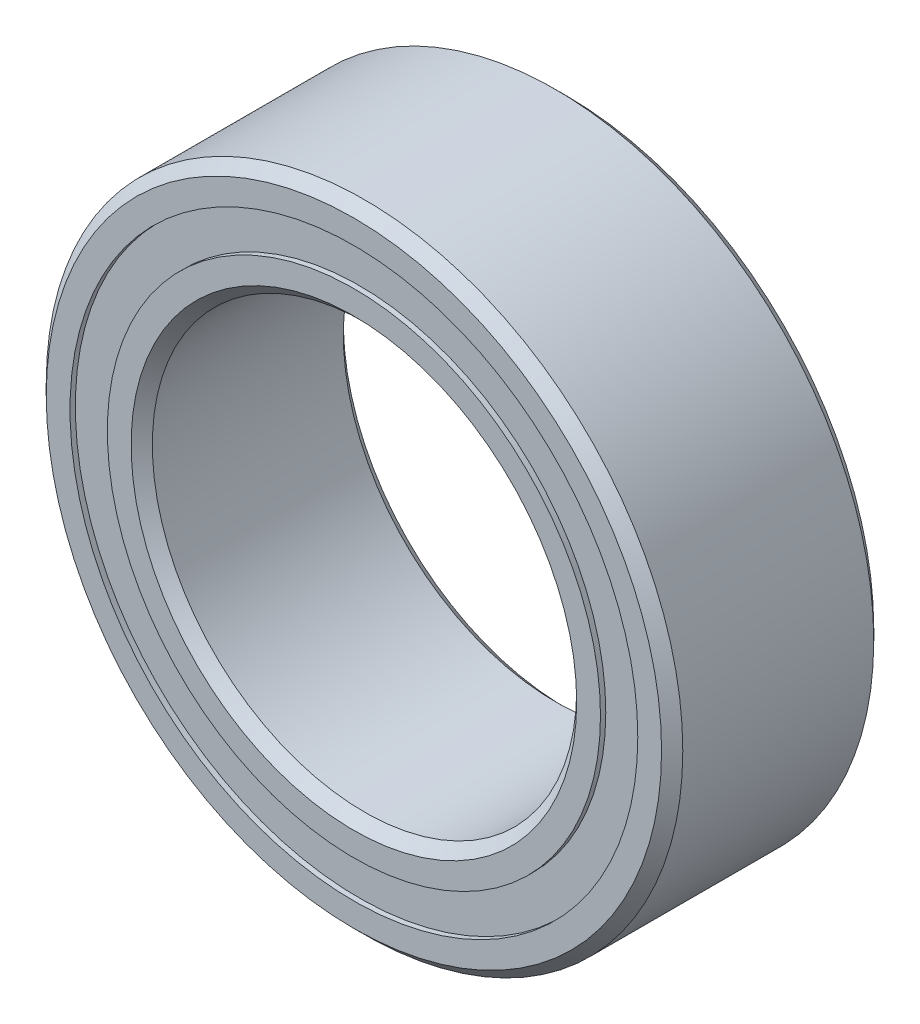
ISO-10303-21;
HEADER;
FILE_DESCRIPTION(('STEP AP214'),'2;1');
FILE_NAME('part.step','',(''),(''),'','','');
FILE_SCHEMA(('AUTOMOTIVE_DESIGN { 1 0 10303 214 1 1 1 1 }'));
ENDSEC;
DATA;
#1=APPLICATION_CONTEXT('core data for automotive mechanical design processes');
#2=APPLICATION_PROTOCOL_DEFINITION('international standard','automotive_design',2000,#1);
#3=PRODUCT_CONTEXT('',#1,'mechanical');
#4=PRODUCT('Part','Part','',(#3));
#5=PRODUCT_RELATED_PRODUCT_CATEGORY('part','',(#4));
#6=PRODUCT_DEFINITION_FORMATION('','',#4);
#7=PRODUCT_DEFINITION_CONTEXT('part definition',#1,'design');
#8=PRODUCT_DEFINITION('design','',#6,#7);
#9=PRODUCT_DEFINITION_SHAPE('','',#8);
#10=(LENGTH_UNIT() NAMED_UNIT(*) SI_UNIT(.MILLI.,.METRE.));
#11=(NAMED_UNIT(*) PLANE_ANGLE_UNIT() SI_UNIT($,.RADIAN.));
#12=(NAMED_UNIT(*) SI_UNIT($,.STERADIAN.) SOLID_ANGLE_UNIT());
#13=UNCERTAINTY_MEASURE_WITH_UNIT(LENGTH_MEASURE(1.E-05),#10,'distance_accuracy_value','');
#14=(GEOMETRIC_REPRESENTATION_CONTEXT(3) GLOBAL_UNCERTAINTY_ASSIGNED_CONTEXT((#13)) GLOBAL_UNIT_ASSIGNED_CONTEXT((#10,
#11,#12)) REPRESENTATION_CONTEXT('',''));
#15=CARTESIAN_POINT('',(0.,0.,0.));
#16=DIRECTION('',(0.,0.,1.));
#17=DIRECTION('',(1.,0.,0.));
#18=AXIS2_PLACEMENT_3D('',#15,#16,#17);
#19=CARTESIAN_POINT('',(3.96875,0.,0.));
#20=DIRECTION('',(1.,0.,0.));
#21=DIRECTION('',(0.,0.,-1.));
#22=AXIS2_PLACEMENT_3D('',#19,#20,#21);
#23=SPHERICAL_SURFACE('',#22,0.758760243513404);
#24=CARTESIAN_POINT('',(3.2099897564866,0.,0.));
#25=VERTEX_POINT('',#24);
#26=VERTEX_LOOP('',#25);
#27=FACE_BOUND('',#26,.T.);
#28=CARTESIAN_POINT('',(4.7275102435134,0.,0.));
#29=VERTEX_POINT('',#28);
#30=VERTEX_LOOP('',#29);
#31=FACE_BOUND('',#30,.T.);
#32=ADVANCED_FACE('P0_F16',(#27,#31),#23,.T.);
#33=CLOSED_SHELL('',(#32));
#34=MANIFOLD_SOLID_BREP('P0_B1',#33);
#35=CARTESIAN_POINT('',(0.,4.24787087912088,-1.508125));
#36=DIRECTION('',(0.,0.,1.));
#37=DIRECTION('',(1.,0.,0.));
#38=AXIS2_PLACEMENT_3D('',#35,#36,#37);
#39=PLANE('',#38);
#40=CARTESIAN_POINT('',(0.,0.,-1.508125));
#41=DIRECTION('',(0.,0.,1.));
#42=DIRECTION('',(1.,0.,0.));
#43=AXIS2_PLACEMENT_3D('',#40,#41,#42);
#44=CIRCLE('',#43,3.68962912087912);
#45=CARTESIAN_POINT('',(3.68962912087912,0.,-1.508125));
#46=VERTEX_POINT('',#45);
#47=EDGE_CURVE('P1_E18',#46,#46,#44,.T.);
#48=ORIENTED_EDGE('',*,*,#47,.T.);
#49=EDGE_LOOP('',(#48));
#50=FACE_BOUND('',#49,.T.);
#51=CARTESIAN_POINT('',(0.,0.,-1.508125));
#52=DIRECTION('',(0.,0.,1.));
#53=DIRECTION('',(1.,0.,0.));
#54=AXIS2_PLACEMENT_3D('',#51,#52,#53);
#55=CIRCLE('',#54,4.24787087912088);
#56=CARTESIAN_POINT('',(4.24787087912088,0.,-1.508125));
#57=VERTEX_POINT('',#56);
#58=EDGE_CURVE('P1_E27',#57,#57,#55,.T.);
#59=ORIENTED_EDGE('',*,*,#58,.F.);
#60=EDGE_LOOP('',(#59));
#61=FACE_BOUND('',#60,.T.);
#62=ADVANCED_FACE('P1_F15',(#50,#61),#39,.F.);
#63=CARTESIAN_POINT('',(0.,0.,1.5875));
#64=DIRECTION('',(0.,0.,1.));
#65=DIRECTION('',(1.,0.,0.));
#66=AXIS2_PLACEMENT_3D('',#63,#64,#65);
#67=CYLINDRICAL_SURFACE('',#66,3.68962912087912);
#68=ORIENTED_EDGE('',*,*,#47,.F.);
#69=EDGE_LOOP('',(#68));
#70=FACE_BOUND('',#69,.T.);
#71=CARTESIAN_POINT('',(0.,0.,-0.758760243513405));
#72=DIRECTION('',(0.,0.,1.));
#73=DIRECTION('',(1.,0.,0.));
#74=AXIS2_PLACEMENT_3D('',#71,#72,#73);
#75=CIRCLE('',#74,3.68962912087912);
#76=CARTESIAN_POINT('',(3.68962912087912,0.,-0.758760243513405));
#77=VERTEX_POINT('',#76);
#78=EDGE_CURVE('P1_E22',#77,#77,#75,.T.);
#79=ORIENTED_EDGE('',*,*,#78,.T.);
#80=EDGE_LOOP('',(#79));
#81=FACE_BOUND('',#80,.T.);
#82=ADVANCED_FACE('P1_F37',(#70,#81),#67,.F.);
#83=CARTESIAN_POINT('',(0.,0.,1.5875));
#84=DIRECTION('',(0.,0.,1.));
#85=DIRECTION('',(1.,0.,0.));
#86=AXIS2_PLACEMENT_3D('',#83,#84,#85);
#87=CYLINDRICAL_SURFACE('',#86,4.24787087912088);
#88=CARTESIAN_POINT('',(0.,0.,-0.758760243513404));
#89=DIRECTION('',(0.,0.,1.));
#90=DIRECTION('',(1.,0.,0.));
#91=AXIS2_PLACEMENT_3D('',#88,#89,#90);
#92=CIRCLE('',#91,4.24787087912088);
#93=CARTESIAN_POINT('',(4.24787087912088,0.,-0.758760243513404));
#94=VERTEX_POINT('',#93);
#95=EDGE_CURVE('P1_E10',#94,#94,#92,.F.);
#96=ORIENTED_EDGE('',*,*,#95,.T.);
#97=EDGE_LOOP('',(#96));
#98=FACE_BOUND('',#97,.T.);
#99=ORIENTED_EDGE('',*,*,#58,.T.);
#100=EDGE_LOOP('',(#99));
#101=FACE_BOUND('',#100,.T.);
#102=ADVANCED_FACE('P1_F40',(#98,#101),#87,.T.);
#103=CARTESIAN_POINT('',(0.,4.24787087912088,-0.758760243513404));
#104=DIRECTION('',(0.,0.,-1.));
#105=DIRECTION('',(-1.,0.,0.));
#106=AXIS2_PLACEMENT_3D('',#103,#104,#105);
#107=PLANE('',#106);
#108=ORIENTED_EDGE('',*,*,#95,.F.);
#109=EDGE_LOOP('',(#108));
#110=FACE_BOUND('',#109,.T.);
#111=ORIENTED_EDGE('',*,*,#78,.F.);
#112=EDGE_LOOP('',(#111));
#113=FACE_BOUND('',#112,.T.);
#114=ADVANCED_FACE('P1_F43',(#110,#113),#107,.F.);
#115=CLOSED_SHELL('',(#62,#82,#102,#114));
#116=MANIFOLD_SOLID_BREP('P1_B1',#115);
#117=CARTESIAN_POINT('',(-3.96875,0.,0.));
#118=DIRECTION('',(-1.,0.,0.));
#119=DIRECTION('',(0.,0.,-1.));
#120=AXIS2_PLACEMENT_3D('',#117,#118,#119);
#121=SPHERICAL_SURFACE('',#120,0.758760243513404);
#122=CARTESIAN_POINT('',(-4.7275102435134,0.,0.));
#123=VERTEX_POINT('',#122);
#124=VERTEX_LOOP('',#123);
#125=FACE_BOUND('',#124,.T.);
#126=CARTESIAN_POINT('',(-3.2099897564866,0.,0.));
#127=VERTEX_POINT('',#126);
#128=VERTEX_LOOP('',#127);
#129=FACE_BOUND('',#128,.T.);
#130=ADVANCED_FACE('P2_F16',(#125,#129),#121,.T.);
#131=CLOSED_SHELL('',(#130));
#132=MANIFOLD_SOLID_BREP('P2_B1',#131);
#133=CARTESIAN_POINT('',(-1.98437499999996,3.43703832126952,0.));
#134=DIRECTION('',(-0.499999999999989,0.866025403784445,0.));
#135=DIRECTION('',(0.,0.,-1.));
#136=AXIS2_PLACEMENT_3D('',#133,#134,#135);
#137=SPHERICAL_SURFACE('',#136,0.758760243513404);
#138=CARTESIAN_POINT('',(-2.36375512175665,4.0941439675338,0.));
#139=VERTEX_POINT('',#138);
#140=VERTEX_LOOP('',#139);
#141=FACE_BOUND('',#140,.T.);
#142=CARTESIAN_POINT('',(-1.60499487824326,2.77993267500524,0.));
#143=VERTEX_POINT('',#142);
#144=VERTEX_LOOP('',#143);
#145=FACE_BOUND('',#144,.T.);
#146=ADVANCED_FACE('P3_F16',(#141,#145),#137,.T.);
#147=CLOSED_SHELL('',(#146));
#148=MANIFOLD_SOLID_BREP('P3_B1',#147);
#149=CARTESIAN_POINT('',(0.,3.96875,0.));
#150=DIRECTION('',(0.,1.,0.));
#151=DIRECTION('',(0.,0.,-1.));
#152=AXIS2_PLACEMENT_3D('',#149,#150,#151);
#153=SPHERICAL_SURFACE('',#152,0.758760243513404);
#154=CARTESIAN_POINT('',(0.,3.2099897564866,0.));
#155=VERTEX_POINT('',#154);
#156=VERTEX_LOOP('',#155);
#157=FACE_BOUND('',#156,.T.);
#158=CARTESIAN_POINT('',(0.,4.7275102435134,0.));
#159=VERTEX_POINT('',#158);
#160=VERTEX_LOOP('',#159);
#161=FACE_BOUND('',#160,.T.);
#162=ADVANCED_FACE('P4_F16',(#157,#161),#153,.T.);
#163=CLOSED_SHELL('',(#162));
#164=MANIFOLD_SOLID_BREP('P4_B1',#163);
#165=CARTESIAN_POINT('',(0.,4.24787087912088,0.758760243513404));
#166=DIRECTION('',(0.,0.,1.));
#167=DIRECTION('',(1.,0.,0.));
#168=AXIS2_PLACEMENT_3D('',#165,#166,#167);
#169=PLANE('',#168);
#170=CARTESIAN_POINT('',(0.,0.,0.758760243513404));
#171=DIRECTION('',(0.,0.,1.));
#172=DIRECTION('',(1.,0.,0.));
#173=AXIS2_PLACEMENT_3D('',#170,#171,#172);
#174=CIRCLE('',#173,3.68962912087912);
#175=CARTESIAN_POINT('',(3.68962912087912,0.,0.758760243513404));
#176=VERTEX_POINT('',#175);
#177=EDGE_CURVE('P5_E18',#176,#176,#174,.T.);
#178=ORIENTED_EDGE('',*,*,#177,.T.);
#179=EDGE_LOOP('',(#178));
#180=FACE_BOUND('',#179,.T.);
#181=CARTESIAN_POINT('',(0.,0.,0.758760243513404));
#182=DIRECTION('',(0.,0.,1.));
#183=DIRECTION('',(1.,0.,0.));
#184=AXIS2_PLACEMENT_3D('',#181,#182,#183);
#185=CIRCLE('',#184,4.24787087912088);
#186=CARTESIAN_POINT('',(4.24787087912088,0.,0.758760243513404));
#187=VERTEX_POINT('',#186);
#188=EDGE_CURVE('P5_E27',#187,#187,#185,.T.);
#189=ORIENTED_EDGE('',*,*,#188,.F.);
#190=EDGE_LOOP('',(#189));
#191=FACE_BOUND('',#190,.T.);
#192=ADVANCED_FACE('P5_F15',(#180,#191),#169,.F.);
#193=CARTESIAN_POINT('',(0.,0.,1.5875));
#194=DIRECTION('',(0.,0.,1.));
#195=DIRECTION('',(1.,0.,0.));
#196=AXIS2_PLACEMENT_3D('',#193,#194,#195);
#197=CYLINDRICAL_SURFACE('',#196,3.68962912087912);
#198=ORIENTED_EDGE('',*,*,#177,.F.);
#199=EDGE_LOOP('',(#198));
#200=FACE_BOUND('',#199,.T.);
#201=CARTESIAN_POINT('',(0.,0.,1.508125));
#202=DIRECTION('',(0.,0.,1.));
#203=DIRECTION('',(1.,0.,0.));
#204=AXIS2_PLACEMENT_3D('',#201,#202,#203);
#205=CIRCLE('',#204,3.68962912087912);
#206=CARTESIAN_POINT('',(3.68962912087912,0.,1.508125));
#207=VERTEX_POINT('',#206);
#208=EDGE_CURVE('P5_E22',#207,#207,#205,.T.);
#209=ORIENTED_EDGE('',*,*,#208,.T.);
#210=EDGE_LOOP('',(#209));
#211=FACE_BOUND('',#210,.T.);
#212=ADVANCED_FACE('P5_F37',(#200,#211),#197,.F.);
#213=CARTESIAN_POINT('',(0.,0.,1.5875));
#214=DIRECTION('',(0.,0.,1.));
#215=DIRECTION('',(1.,0.,0.));
#216=AXIS2_PLACEMENT_3D('',#213,#214,#215);
#217=CYLINDRICAL_SURFACE('',#216,4.24787087912088);
#218=CARTESIAN_POINT('',(0.,0.,1.508125));
#219=DIRECTION('',(0.,0.,1.));
#220=DIRECTION('',(1.,0.,0.));
#221=AXIS2_PLACEMENT_3D('',#218,#219,#220);
#222=CIRCLE('',#221,4.24787087912088);
#223=CARTESIAN_POINT('',(4.24787087912088,0.,1.508125));
#224=VERTEX_POINT('',#223);
#225=EDGE_CURVE('P5_E10',#224,#224,#222,.F.);
#226=ORIENTED_EDGE('',*,*,#225,.T.);
#227=EDGE_LOOP('',(#226));
#228=FACE_BOUND('',#227,.T.);
#229=ORIENTED_EDGE('',*,*,#188,.T.);
#230=EDGE_LOOP('',(#229));
#231=FACE_BOUND('',#230,.T.);
#232=ADVANCED_FACE('P5_F40',(#228,#231),#217,.T.);
#233=CARTESIAN_POINT('',(0.,4.24787087912088,1.508125));
#234=DIRECTION('',(0.,0.,-1.));
#235=DIRECTION('',(-1.,0.,0.));
#236=AXIS2_PLACEMENT_3D('',#233,#234,#235);
#237=PLANE('',#236);
#238=ORIENTED_EDGE('',*,*,#225,.F.);
#239=EDGE_LOOP('',(#238));
#240=FACE_BOUND('',#239,.T.);
#241=ORIENTED_EDGE('',*,*,#208,.F.);
#242=EDGE_LOOP('',(#241));
#243=FACE_BOUND('',#242,.T.);
#244=ADVANCED_FACE('P5_F43',(#240,#243),#237,.F.);
#245=CLOSED_SHELL('',(#192,#212,#232,#244));
#246=MANIFOLD_SOLID_BREP('P5_B1',#245);
#247=CARTESIAN_POINT('',(0.,0.,0.));
#248=DIRECTION('',(0.,0.,1.));
#249=DIRECTION('',(1.,0.,0.));
#250=AXIS2_PLACEMENT_3D('',#247,#248,#249);
#251=TOROIDAL_SURFACE('',#250,3.96875,0.758760243513403);
#252=CARTESIAN_POINT('',(0.,0.,0.705555555555556));
#253=DIRECTION('',(0.,0.,1.));
#254=DIRECTION('',(1.,0.,0.));
#255=AXIS2_PLACEMENT_3D('',#252,#253,#254);
#256=CIRCLE('',#255,3.68962912087912);
#257=CARTESIAN_POINT('',(3.68962912087912,0.,0.705555555555556));
#258=VERTEX_POINT('',#257);
#259=EDGE_CURVE('P6_E33',#258,#258,#256,.T.);
#260=ORIENTED_EDGE('',*,*,#259,.F.);
#261=EDGE_LOOP('',(#260));
#262=FACE_BOUND('',#261,.T.);
#263=CARTESIAN_POINT('',(0.,0.,-0.705555555555556));
#264=DIRECTION('',(0.,0.,1.));
#265=DIRECTION('',(1.,0.,0.));
#266=AXIS2_PLACEMENT_3D('',#263,#264,#265);
#267=CIRCLE('',#266,3.68962912087912);
#268=CARTESIAN_POINT('',(3.68962912087912,0.,-0.705555555555556));
#269=VERTEX_POINT('',#268);
#270=EDGE_CURVE('P6_E31',#269,#269,#267,.F.);
#271=ORIENTED_EDGE('',*,*,#270,.F.);
#272=EDGE_LOOP('',(#271));
#273=FACE_BOUND('',#272,.T.);
#274=ADVANCED_FACE('P6_F15',(#262,#273),#251,.F.);
#275=CARTESIAN_POINT('',(0.,0.,1.5875));
#276=DIRECTION('',(0.,0.,1.));
#277=DIRECTION('',(1.,0.,0.));
#278=AXIS2_PLACEMENT_3D('',#275,#276,#277);
#279=CYLINDRICAL_SURFACE('',#278,3.68962912087912);
#280=CARTESIAN_POINT('',(0.,0.,1.5875));
#281=DIRECTION('',(0.,0.,1.));
#282=DIRECTION('',(1.,0.,0.));
#283=AXIS2_PLACEMENT_3D('',#280,#281,#282);
#284=CIRCLE('',#283,3.68962912087912);
#285=CARTESIAN_POINT('',(3.68962912087912,0.,1.5875));
#286=VERTEX_POINT('',#285);
#287=EDGE_CURVE('P6_E19',#286,#286,#284,.F.);
#288=ORIENTED_EDGE('',*,*,#287,.T.);
#289=EDGE_LOOP('',(#288));
#290=FACE_BOUND('',#289,.T.);
#291=ORIENTED_EDGE('',*,*,#259,.T.);
#292=EDGE_LOOP('',(#291));
#293=FACE_BOUND('',#292,.T.);
#294=ADVANCED_FACE('P6_F49',(#290,#293),#279,.T.);
#295=CARTESIAN_POINT('',(0.,0.,1.5875));
#296=DIRECTION('',(0.,0.,1.));
#297=DIRECTION('',(1.,0.,0.));
#298=AXIS2_PLACEMENT_3D('',#295,#296,#297);
#299=CYLINDRICAL_SURFACE('',#298,3.68962912087912);
#300=ORIENTED_EDGE('',*,*,#270,.T.);
#301=EDGE_LOOP('',(#300));
#302=FACE_BOUND('',#301,.T.);
#303=CARTESIAN_POINT('',(0.,0.,-1.5875));
#304=DIRECTION('',(0.,0.,1.));
#305=DIRECTION('',(1.,0.,0.));
#306=AXIS2_PLACEMENT_3D('',#303,#304,#305);
#307=CIRCLE('',#306,3.68962912087912);
#308=CARTESIAN_POINT('',(3.68962912087912,0.,-1.5875));
#309=VERTEX_POINT('',#308);
#310=EDGE_CURVE('P6_E42',#309,#309,#307,.T.);
#311=ORIENTED_EDGE('',*,*,#310,.T.);
#312=EDGE_LOOP('',(#311));
#313=FACE_BOUND('',#312,.T.);
#314=ADVANCED_FACE('P6_F56',(#302,#313),#299,.T.);
#315=CARTESIAN_POINT('',(0.,3.68962912087912,1.5875));
#316=DIRECTION('',(0.,0.,-1.));
#317=DIRECTION('',(-1.,0.,0.));
#318=AXIS2_PLACEMENT_3D('',#315,#316,#317);
#319=PLANE('',#318);
#320=ORIENTED_EDGE('',*,*,#287,.F.);
#321=EDGE_LOOP('',(#320));
#322=FACE_BOUND('',#321,.T.);
#323=CARTESIAN_POINT('',(0.,0.,1.58749999997099));
#324=DIRECTION('',(0.,0.,1.));
#325=DIRECTION('',(1.,0.,0.));
#326=AXIS2_PLACEMENT_3D('',#323,#324,#325);
#327=CIRCLE('',#326,3.33374999996749);
#328=CARTESIAN_POINT('',(3.33374999996749,0.,1.58749999997099));
#329=VERTEX_POINT('',#328);
#330=EDGE_CURVE('P6_E40',#329,#329,#327,.F.);
#331=ORIENTED_EDGE('',*,*,#330,.T.);
#332=EDGE_LOOP('',(#331));
#333=FACE_BOUND('',#332,.T.);
#334=ADVANCED_FACE('P6_F52',(#322,#333),#319,.F.);
#335=CARTESIAN_POINT('',(0.,3.33375,-1.5875));
#336=DIRECTION('',(0.,0.,1.));
#337=DIRECTION('',(1.,0.,0.));
#338=AXIS2_PLACEMENT_3D('',#335,#336,#337);
#339=PLANE('',#338);
#340=CARTESIAN_POINT('',(0.,0.,-1.58749999997099));
#341=DIRECTION('',(0.,0.,-1.));
#342=DIRECTION('',(0.,1.,0.));
#343=AXIS2_PLACEMENT_3D('',#340,#341,#342);
#344=CIRCLE('',#343,3.33375000002434);
#345=CARTESIAN_POINT('',(0.,3.33375000002434,-1.58749999997099));
#346=VERTEX_POINT('',#345);
#347=EDGE_CURVE('P6_E28',#346,#346,#344,.F.);
#348=ORIENTED_EDGE('',*,*,#347,.T.);
#349=EDGE_LOOP('',(#348));
#350=FACE_BOUND('',#349,.T.);
#351=ORIENTED_EDGE('',*,*,#310,.F.);
#352=EDGE_LOOP('',(#351));
#353=FACE_BOUND('',#352,.T.);
#354=ADVANCED_FACE('P6_F55',(#350,#353),#339,.F.);
#355=CARTESIAN_POINT('',(0.,0.,1.58749999991414));
#356=DIRECTION('',(0.,0.,1.));
#357=DIRECTION('',(1.,0.,0.));
#358=AXIS2_PLACEMENT_3D('',#355,#356,#357);
#359=CONICAL_SURFACE('',#358,3.33374999991065,0.785398163397448);
#360=ORIENTED_EDGE('',*,*,#330,.F.);
#361=EDGE_LOOP('',(#360));
#362=FACE_BOUND('',#361,.T.);
#363=CARTESIAN_POINT('',(0.,0.,1.42875));
#364=DIRECTION('',(0.,0.,1.));
#365=DIRECTION('',(1.,0.,0.));
#366=AXIS2_PLACEMENT_3D('',#363,#364,#365);
#367=CIRCLE('',#366,3.175);
#368=CARTESIAN_POINT('',(3.175,0.,1.42875));
#369=VERTEX_POINT('',#368);
#370=EDGE_CURVE('P6_E23',#369,#369,#367,.F.);
#371=ORIENTED_EDGE('',*,*,#370,.T.);
#372=EDGE_LOOP('',(#371));
#373=FACE_BOUND('',#372,.T.);
#374=ADVANCED_FACE('P6_F60',(#362,#373),#359,.F.);
#375=CARTESIAN_POINT('',(0.,0.,-1.58749999997099));
#376=DIRECTION('',(0.,0.,-1.));
#377=DIRECTION('',(0.,1.,0.));
#378=AXIS2_PLACEMENT_3D('',#375,#376,#377);
#379=CONICAL_SURFACE('',#378,3.33375000002434,0.785398163397448);
#380=CARTESIAN_POINT('',(0.,0.,-1.42875));
#381=DIRECTION('',(0.,0.,1.));
#382=DIRECTION('',(1.,0.,0.));
#383=AXIS2_PLACEMENT_3D('',#380,#381,#382);
#384=CIRCLE('',#383,3.175);
#385=CARTESIAN_POINT('',(3.175,0.,-1.42875));
#386=VERTEX_POINT('',#385);
#387=EDGE_CURVE('P6_E10',#386,#386,#384,.T.);
#388=ORIENTED_EDGE('',*,*,#387,.T.);
#389=EDGE_LOOP('',(#388));
#390=FACE_BOUND('',#389,.T.);
#391=ORIENTED_EDGE('',*,*,#347,.F.);
#392=EDGE_LOOP('',(#391));
#393=FACE_BOUND('',#392,.T.);
#394=ADVANCED_FACE('P6_F63',(#390,#393),#379,.F.);
#395=CARTESIAN_POINT('',(0.,0.,1.5875));
#396=DIRECTION('',(0.,0.,1.));
#397=DIRECTION('',(1.,0.,0.));
#398=AXIS2_PLACEMENT_3D('',#395,#396,#397);
#399=CYLINDRICAL_SURFACE('',#398,3.175);
#400=ORIENTED_EDGE('',*,*,#370,.F.);
#401=EDGE_LOOP('',(#400));
#402=FACE_BOUND('',#401,.T.);
#403=ORIENTED_EDGE('',*,*,#387,.F.);
#404=EDGE_LOOP('',(#403));
#405=FACE_BOUND('',#404,.T.);
#406=ADVANCED_FACE('P6_F67',(#402,#405),#399,.F.);
#407=CLOSED_SHELL('',(#274,#294,#314,#334,#354,#374,#394,#406));
#408=MANIFOLD_SOLID_BREP('P6_B1',#407);
#409=CARTESIAN_POINT('',(3.4370383212695,1.98437499999999,0.));
#410=DIRECTION('',(0.86602540378444,0.499999999999998,0.));
#411=DIRECTION('',(0.,0.,-1.));
#412=AXIS2_PLACEMENT_3D('',#409,#410,#411);
#413=SPHERICAL_SURFACE('',#412,0.758760243513404);
#414=CARTESIAN_POINT('',(4.09414396753377,2.36375512175669,0.));
#415=VERTEX_POINT('',#414);
#416=VERTEX_LOOP('',#415);
#417=FACE_BOUND('',#416,.T.);
#418=CARTESIAN_POINT('',(2.77993267500522,1.60499487824329,0.));
#419=VERTEX_POINT('',#418);
#420=VERTEX_LOOP('',#419);
#421=FACE_BOUND('',#420,.T.);
#422=ADVANCED_FACE('P7_F16',(#417,#421),#413,.T.);
#423=CLOSED_SHELL('',(#422));
#424=MANIFOLD_SOLID_BREP('P7_B1',#423);
#425=CARTESIAN_POINT('',(3.43703832126948,-1.98437500000002,0.));
#426=DIRECTION('',(0.866025403784437,-0.500000000000004,0.));
#427=DIRECTION('',(0.,0.,-1.));
#428=AXIS2_PLACEMENT_3D('',#425,#426,#427);
#429=SPHERICAL_SURFACE('',#428,0.758760243513404);
#430=CARTESIAN_POINT('',(4.09414396753376,-2.36375512175672,0.));
#431=VERTEX_POINT('',#430);
#432=VERTEX_LOOP('',#431);
#433=FACE_BOUND('',#432,.T.);
#434=CARTESIAN_POINT('',(2.77993267500521,-1.60499487824331,0.));
#435=VERTEX_POINT('',#434);
#436=VERTEX_LOOP('',#435);
#437=FACE_BOUND('',#436,.T.);
#438=ADVANCED_FACE('P8_F16',(#433,#437),#429,.T.);
#439=CLOSED_SHELL('',(#438));
#440=MANIFOLD_SOLID_BREP('P8_B1',#439);
#441=CARTESIAN_POINT('',(-3.43703832126947,1.98437500000004,0.));
#442=DIRECTION('',(-0.866025403784433,0.50000000000001,0.));
#443=DIRECTION('',(0.,0.,-1.));
#444=AXIS2_PLACEMENT_3D('',#441,#442,#443);
#445=SPHERICAL_SURFACE('',#444,0.758760243513404);
#446=CARTESIAN_POINT('',(-4.09414396753374,2.36375512175675,0.));
#447=VERTEX_POINT('',#446);
#448=VERTEX_LOOP('',#447);
#449=FACE_BOUND('',#448,.T.);
#450=CARTESIAN_POINT('',(-2.7799326750052,1.60499487824333,0.));
#451=VERTEX_POINT('',#450);
#452=VERTEX_LOOP('',#451);
#453=FACE_BOUND('',#452,.T.);
#454=ADVANCED_FACE('P9_F16',(#449,#453),#445,.T.);
#455=CLOSED_SHELL('',(#454));
#456=MANIFOLD_SOLID_BREP('P9_B1',#455);
#457=CARTESIAN_POINT('',(-1.98437500000003,-3.43703832126947,0.));
#458=DIRECTION('',(-0.500000000000007,-0.866025403784435,0.));
#459=DIRECTION('',(0.,0.,-1.));
#460=AXIS2_PLACEMENT_3D('',#457,#458,#459);
#461=SPHERICAL_SURFACE('',#460,0.758760243513404);
#462=CARTESIAN_POINT('',(-2.36375512175674,-4.09414396753375,0.));
#463=VERTEX_POINT('',#462);
#464=VERTEX_LOOP('',#463);
#465=FACE_BOUND('',#464,.T.);
#466=CARTESIAN_POINT('',(-1.60499487824332,-2.7799326750052,0.));
#467=VERTEX_POINT('',#466);
#468=VERTEX_LOOP('',#467);
#469=FACE_BOUND('',#468,.T.);
#470=ADVANCED_FACE('P10_F16',(#465,#469),#461,.T.);
#471=CLOSED_SHELL('',(#470));
#472=MANIFOLD_SOLID_BREP('P10_B1',#471);
#473=CARTESIAN_POINT('',(0.,-3.96875,0.));
#474=DIRECTION('',(0.,-1.,0.));
#475=DIRECTION('',(0.,0.,-1.));
#476=AXIS2_PLACEMENT_3D('',#473,#474,#475);
#477=SPHERICAL_SURFACE('',#476,0.758760243513404);
#478=CARTESIAN_POINT('',(0.,-3.2099897564866,0.));
#479=VERTEX_POINT('',#478);
#480=VERTEX_LOOP('',#479);
#481=FACE_BOUND('',#480,.T.);
#482=CARTESIAN_POINT('',(0.,-4.7275102435134,0.));
#483=VERTEX_POINT('',#482);
#484=VERTEX_LOOP('',#483);
#485=FACE_BOUND('',#484,.T.);
#486=ADVANCED_FACE('P11_F16',(#481,#485),#477,.T.);
#487=CLOSED_SHELL('',(#486));
#488=MANIFOLD_SOLID_BREP('P11_B1',#487);
#489=CARTESIAN_POINT('',(1.984375,3.43703832126949,0.));
#490=DIRECTION('',(0.500000000000001,0.866025403784438,0.));
#491=DIRECTION('',(0.,0.,-1.));
#492=AXIS2_PLACEMENT_3D('',#489,#490,#491);
#493=SPHERICAL_SURFACE('',#492,0.758760243513404);
#494=CARTESIAN_POINT('',(2.36375512175671,4.09414396753376,0.));
#495=VERTEX_POINT('',#494);
#496=VERTEX_LOOP('',#495);
#497=FACE_BOUND('',#496,.T.);
#498=CARTESIAN_POINT('',(1.6049948782433,2.77993267500521,0.));
#499=VERTEX_POINT('',#498);
#500=VERTEX_LOOP('',#499);
#501=FACE_BOUND('',#500,.T.);
#502=ADVANCED_FACE('P12_F16',(#497,#501),#493,.T.);
#503=CLOSED_SHELL('',(#502));
#504=MANIFOLD_SOLID_BREP('P12_B1',#503);
#505=CARTESIAN_POINT('',(1.98437499999998,-3.4370383212695,0.));
#506=DIRECTION('',(0.499999999999995,-0.866025403784442,0.));
#507=DIRECTION('',(0.,0.,-1.));
#508=AXIS2_PLACEMENT_3D('',#505,#506,#507);
#509=SPHERICAL_SURFACE('',#508,0.758760243513404);
#510=CARTESIAN_POINT('',(1.60499487824328,-2.77993267500523,0.));
#511=VERTEX_POINT('',#510);
#512=VERTEX_LOOP('',#511);
#513=FACE_BOUND('',#512,.T.);
#514=CARTESIAN_POINT('',(2.36375512175668,-4.09414396753378,0.));
#515=VERTEX_POINT('',#514);
#516=VERTEX_LOOP('',#515);
#517=FACE_BOUND('',#516,.T.);
#518=ADVANCED_FACE('P13_F16',(#513,#517),#509,.T.);
#519=CLOSED_SHELL('',(#518));
#520=MANIFOLD_SOLID_BREP('P13_B1',#519);
#521=CARTESIAN_POINT('',(-3.43703832126951,-1.98437499999997,0.));
#522=DIRECTION('',(-0.866025403784443,-0.499999999999992,0.));
#523=DIRECTION('',(0.,0.,-1.));
#524=AXIS2_PLACEMENT_3D('',#521,#522,#523);
#525=SPHERICAL_SURFACE('',#524,0.758760243513404);
#526=CARTESIAN_POINT('',(-4.09414396753379,-2.36375512175666,0.));
#527=VERTEX_POINT('',#526);
#528=VERTEX_LOOP('',#527);
#529=FACE_BOUND('',#528,.T.);
#530=CARTESIAN_POINT('',(-2.77993267500523,-1.60499487824327,0.));
#531=VERTEX_POINT('',#530);
#532=VERTEX_LOOP('',#531);
#533=FACE_BOUND('',#532,.T.);
#534=ADVANCED_FACE('P14_F16',(#529,#533),#525,.T.);
#535=CLOSED_SHELL('',(#534));
#536=MANIFOLD_SOLID_BREP('P14_B1',#535);
#537=CARTESIAN_POINT('',(0.,0.,0.));
#538=DIRECTION('',(0.,0.,1.));
#539=DIRECTION('',(1.,0.,0.));
#540=AXIS2_PLACEMENT_3D('',#537,#538,#539);
#541=TOROIDAL_SURFACE('',#540,3.96875,0.758760243513404);
#542=CARTESIAN_POINT('',(0.,0.,-0.705555555555556));
#543=DIRECTION('',(0.,0.,1.));
#544=DIRECTION('',(1.,0.,0.));
#545=AXIS2_PLACEMENT_3D('',#542,#543,#544);
#546=CIRCLE('',#545,4.24787087912088);
#547=CARTESIAN_POINT('',(4.24787087912088,0.,-0.705555555555556));
#548=VERTEX_POINT('',#547);
#549=EDGE_CURVE('P15_E33',#548,#548,#546,.F.);
#550=ORIENTED_EDGE('',*,*,#549,.T.);
#551=EDGE_LOOP('',(#550));
#552=FACE_BOUND('',#551,.T.);
#553=CARTESIAN_POINT('',(0.,0.,0.705555555555555));
#554=DIRECTION('',(0.,0.,1.));
#555=DIRECTION('',(1.,0.,0.));
#556=AXIS2_PLACEMENT_3D('',#553,#554,#555);
#557=CIRCLE('',#556,4.24787087912088);
#558=CARTESIAN_POINT('',(4.24787087912088,0.,0.705555555555555));
#559=VERTEX_POINT('',#558);
#560=EDGE_CURVE('P15_E31',#559,#559,#557,.T.);
#561=ORIENTED_EDGE('',*,*,#560,.T.);
#562=EDGE_LOOP('',(#561));
#563=FACE_BOUND('',#562,.T.);
#564=ADVANCED_FACE('P15_F15',(#552,#563),#541,.F.);
#565=CARTESIAN_POINT('',(0.,0.,1.5875));
#566=DIRECTION('',(0.,0.,1.));
#567=DIRECTION('',(1.,0.,0.));
#568=AXIS2_PLACEMENT_3D('',#565,#566,#567);
#569=CYLINDRICAL_SURFACE('',#568,4.24787087912088);
#570=CARTESIAN_POINT('',(0.,0.,-1.5875));
#571=DIRECTION('',(0.,0.,1.));
#572=DIRECTION('',(1.,0.,0.));
#573=AXIS2_PLACEMENT_3D('',#570,#571,#572);
#574=CIRCLE('',#573,4.24787087912088);
#575=CARTESIAN_POINT('',(4.24787087912088,0.,-1.5875));
#576=VERTEX_POINT('',#575);
#577=EDGE_CURVE('P15_E19',#576,#576,#574,.F.);
#578=ORIENTED_EDGE('',*,*,#577,.T.);
#579=EDGE_LOOP('',(#578));
#580=FACE_BOUND('',#579,.T.);
#581=ORIENTED_EDGE('',*,*,#549,.F.);
#582=EDGE_LOOP('',(#581));
#583=FACE_BOUND('',#582,.T.);
#584=ADVANCED_FACE('P15_F49',(#580,#583),#569,.F.);
#585=CARTESIAN_POINT('',(0.,0.,1.5875));
#586=DIRECTION('',(0.,0.,1.));
#587=DIRECTION('',(1.,0.,0.));
#588=AXIS2_PLACEMENT_3D('',#585,#586,#587);
#589=CYLINDRICAL_SURFACE('',#588,4.24787087912088);
#590=ORIENTED_EDGE('',*,*,#560,.F.);
#591=EDGE_LOOP('',(#590));
#592=FACE_BOUND('',#591,.T.);
#593=CARTESIAN_POINT('',(0.,0.,1.5875));
#594=DIRECTION('',(0.,0.,1.));
#595=DIRECTION('',(1.,0.,0.));
#596=AXIS2_PLACEMENT_3D('',#593,#594,#595);
#597=CIRCLE('',#596,4.24787087912088);
#598=CARTESIAN_POINT('',(4.24787087912088,0.,1.5875));
#599=VERTEX_POINT('',#598);
#600=EDGE_CURVE('P15_E42',#599,#599,#597,.T.);
#601=ORIENTED_EDGE('',*,*,#600,.T.);
#602=EDGE_LOOP('',(#601));
#603=FACE_BOUND('',#602,.T.);
#604=ADVANCED_FACE('P15_F56',(#592,#603),#589,.F.);
#605=CARTESIAN_POINT('',(0.,4.60375,-1.5875));
#606=DIRECTION('',(0.,0.,1.));
#607=DIRECTION('',(1.,0.,0.));
#608=AXIS2_PLACEMENT_3D('',#605,#606,#607);
#609=PLANE('',#608);
#610=ORIENTED_EDGE('',*,*,#577,.F.);
#611=EDGE_LOOP('',(#610));
#612=FACE_BOUND('',#611,.T.);
#613=CARTESIAN_POINT('',(0.,0.,-1.58750000008467));
#614=DIRECTION('',(0.,0.,1.));
#615=DIRECTION('',(1.,0.,0.));
#616=AXIS2_PLACEMENT_3D('',#613,#614,#615);
#617=CIRCLE('',#616,4.60375000000113);
#618=CARTESIAN_POINT('',(4.60375000000113,0.,-1.58750000008467));
#619=VERTEX_POINT('',#618);
#620=EDGE_CURVE('P15_E40',#619,#619,#617,.T.);
#621=ORIENTED_EDGE('',*,*,#620,.F.);
#622=EDGE_LOOP('',(#621));
#623=FACE_BOUND('',#622,.T.);
#624=ADVANCED_FACE('P15_F52',(#612,#623),#609,.F.);
#625=CARTESIAN_POINT('',(0.,4.60375,1.5875));
#626=DIRECTION('',(0.,0.,-1.));
#627=DIRECTION('',(-1.,0.,0.));
#628=AXIS2_PLACEMENT_3D('',#625,#626,#627);
#629=PLANE('',#628);
#630=CARTESIAN_POINT('',(0.,0.,1.58750000008467));
#631=DIRECTION('',(0.,0.,-1.));
#632=DIRECTION('',(-1.,0.,0.));
#633=AXIS2_PLACEMENT_3D('',#630,#631,#632);
#634=CIRCLE('',#633,4.60375000000113);
#635=CARTESIAN_POINT('',(-4.60375000000113,0.,1.58750000008467));
#636=VERTEX_POINT('',#635);
#637=EDGE_CURVE('P15_E28',#636,#636,#634,.T.);
#638=ORIENTED_EDGE('',*,*,#637,.F.);
#639=EDGE_LOOP('',(#638));
#640=FACE_BOUND('',#639,.T.);
#641=ORIENTED_EDGE('',*,*,#600,.F.);
#642=EDGE_LOOP('',(#641));
#643=FACE_BOUND('',#642,.T.);
#644=ADVANCED_FACE('P15_F55',(#640,#643),#629,.F.);
#645=CARTESIAN_POINT('',(0.,0.,-1.42875000000231));
#646=DIRECTION('',(0.,0.,1.));
#647=DIRECTION('',(1.,0.,0.));
#648=AXIS2_PLACEMENT_3D('',#645,#646,#647);
#649=CONICAL_SURFACE('',#648,4.76250000002665,0.785398163218414);
#650=CARTESIAN_POINT('',(0.,0.,-1.42875));
#651=DIRECTION('',(0.,0.,1.));
#652=DIRECTION('',(1.,0.,0.));
#653=AXIS2_PLACEMENT_3D('',#650,#651,#652);
#654=CIRCLE('',#653,4.7625);
#655=CARTESIAN_POINT('',(4.7625,0.,-1.42875));
#656=VERTEX_POINT('',#655);
#657=EDGE_CURVE('P15_E23',#656,#656,#654,.T.);
#658=ORIENTED_EDGE('',*,*,#657,.F.);
#659=EDGE_LOOP('',(#658));
#660=FACE_BOUND('',#659,.T.);
#661=ORIENTED_EDGE('',*,*,#620,.T.);
#662=EDGE_LOOP('',(#661));
#663=FACE_BOUND('',#662,.T.);
#664=ADVANCED_FACE('P15_F60',(#660,#663),#649,.T.);
#665=CARTESIAN_POINT('',(0.,0.,1.42875000005915));
#666=DIRECTION('',(0.,0.,-1.));
#667=DIRECTION('',(-1.,0.,0.));
#668=AXIS2_PLACEMENT_3D('',#665,#666,#667);
#669=CONICAL_SURFACE('',#668,4.7624999999698,0.785398163218414);
#670=CARTESIAN_POINT('',(0.,0.,1.42875));
#671=DIRECTION('',(0.,0.,1.));
#672=DIRECTION('',(1.,0.,0.));
#673=AXIS2_PLACEMENT_3D('',#670,#671,#672);
#674=CIRCLE('',#673,4.7625);
#675=CARTESIAN_POINT('',(4.7625,0.,1.42875));
#676=VERTEX_POINT('',#675);
#677=EDGE_CURVE('P15_E10',#676,#676,#674,.F.);
#678=ORIENTED_EDGE('',*,*,#677,.F.);
#679=EDGE_LOOP('',(#678));
#680=FACE_BOUND('',#679,.T.);
#681=ORIENTED_EDGE('',*,*,#637,.T.);
#682=EDGE_LOOP('',(#681));
#683=FACE_BOUND('',#682,.T.);
#684=ADVANCED_FACE('P15_F62',(#680,#683),#669,.T.);
#685=CARTESIAN_POINT('',(0.,0.,1.5875));
#686=DIRECTION('',(0.,0.,1.));
#687=DIRECTION('',(1.,0.,0.));
#688=AXIS2_PLACEMENT_3D('',#685,#686,#687);
#689=CYLINDRICAL_SURFACE('',#688,4.7625);
#690=ORIENTED_EDGE('',*,*,#677,.T.);
#691=EDGE_LOOP('',(#690));
#692=FACE_BOUND('',#691,.T.);
#693=ORIENTED_EDGE('',*,*,#657,.T.);
#694=EDGE_LOOP('',(#693));
#695=FACE_BOUND('',#694,.T.);
#696=ADVANCED_FACE('P15_F70',(#692,#695),#689,.T.);
#697=CLOSED_SHELL('',(#564,#584,#604,#624,#644,#664,#684,#696));
#698=MANIFOLD_SOLID_BREP('P15_B1',#697);
#699=ADVANCED_BREP_SHAPE_REPRESENTATION('',(#18,#34,#116,#132,#148,#164,#246,#408,#424,#440,
#456,#472,#488,#504,#520,#536,#698),#14);
#700=SHAPE_DEFINITION_REPRESENTATION(#9,#699);
ENDSEC;
END-ISO-10303-21;
